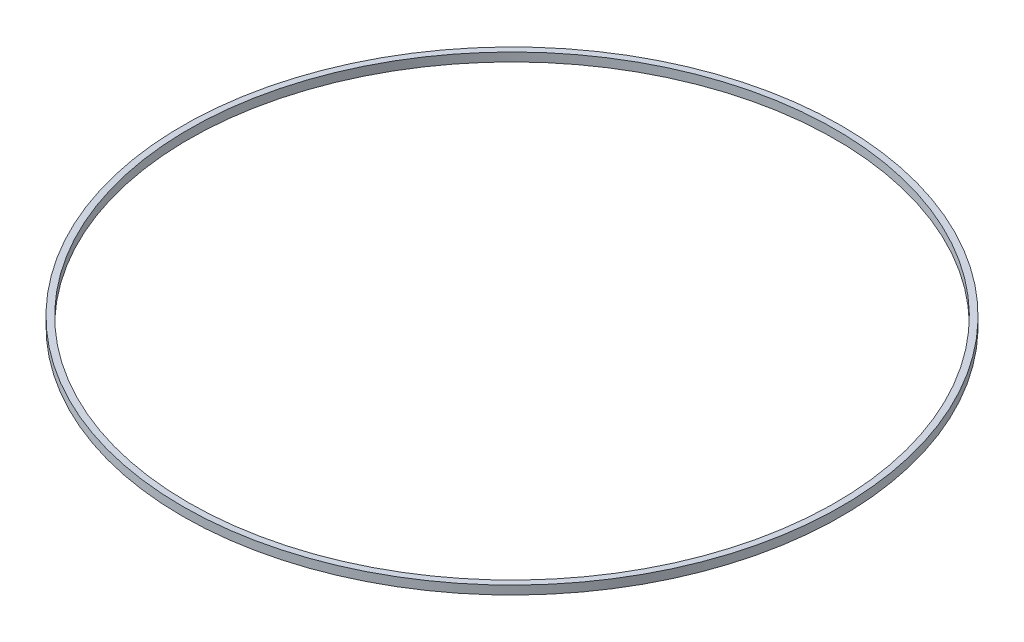
ISO-10303-21;
HEADER;
FILE_DESCRIPTION(('STEP AP214'),'2;1');
FILE_NAME('part.step','',(''),(''),'','','');
FILE_SCHEMA(('AUTOMOTIVE_DESIGN { 1 0 10303 214 1 1 1 1 }'));
ENDSEC;
DATA;
#1=APPLICATION_CONTEXT('core data for automotive mechanical design processes');
#2=APPLICATION_PROTOCOL_DEFINITION('international standard','automotive_design',2000,#1);
#3=PRODUCT_CONTEXT('',#1,'mechanical');
#4=PRODUCT('Part','Part','',(#3));
#5=PRODUCT_RELATED_PRODUCT_CATEGORY('part','',(#4));
#6=PRODUCT_DEFINITION_FORMATION('','',#4);
#7=PRODUCT_DEFINITION_CONTEXT('part definition',#1,'design');
#8=PRODUCT_DEFINITION('design','',#6,#7);
#9=PRODUCT_DEFINITION_SHAPE('','',#8);
#10=(LENGTH_UNIT() NAMED_UNIT(*) SI_UNIT(.MILLI.,.METRE.));
#11=(NAMED_UNIT(*) PLANE_ANGLE_UNIT() SI_UNIT($,.RADIAN.));
#12=(NAMED_UNIT(*) SI_UNIT($,.STERADIAN.) SOLID_ANGLE_UNIT());
#13=UNCERTAINTY_MEASURE_WITH_UNIT(LENGTH_MEASURE(1.E-05),#10,'distance_accuracy_value','');
#14=(GEOMETRIC_REPRESENTATION_CONTEXT(3) GLOBAL_UNCERTAINTY_ASSIGNED_CONTEXT((#13)) GLOBAL_UNIT_ASSIGNED_CONTEXT((#10,
#11,#12)) REPRESENTATION_CONTEXT('',''));
#15=CARTESIAN_POINT('',(0.,0.,0.));
#16=DIRECTION('',(0.,0.,1.));
#17=DIRECTION('',(1.,0.,0.));
#18=AXIS2_PLACEMENT_3D('',#15,#16,#17);
#19=CARTESIAN_POINT('',(0.,1.4,0.));
#20=DIRECTION('',(0.,1.,0.));
#21=DIRECTION('',(0.,0.,1.));
#22=AXIS2_PLACEMENT_3D('',#19,#20,#21);
#23=PLANE('',#22);
#24=CARTESIAN_POINT('',(0.,1.4,0.));
#25=DIRECTION('',(0.,1.,0.));
#26=DIRECTION('',(0.,0.,1.));
#27=AXIS2_PLACEMENT_3D('',#24,#25,#26);
#28=CIRCLE('',#27,53.52);
#29=CARTESIAN_POINT('',(0.,1.4,53.52));
#30=VERTEX_POINT('',#29);
#31=EDGE_CURVE('E10',#30,#30,#28,.T.);
#32=ORIENTED_EDGE('',*,*,#31,.T.);
#33=EDGE_LOOP('',(#32));
#34=FACE_BOUND('',#33,.T.);
#35=CARTESIAN_POINT('',(0.,1.4,0.));
#36=DIRECTION('',(0.,1.,0.));
#37=DIRECTION('',(0.,0.,1.));
#38=AXIS2_PLACEMENT_3D('',#35,#36,#37);
#39=CIRCLE('',#38,52.52);
#40=CARTESIAN_POINT('',(0.,1.4,52.52));
#41=VERTEX_POINT('',#40);
#42=EDGE_CURVE('E42',#41,#41,#39,.T.);
#43=ORIENTED_EDGE('',*,*,#42,.F.);
#44=EDGE_LOOP('',(#43));
#45=FACE_BOUND('',#44,.T.);
#46=ADVANCED_FACE('F31',(#34,#45),#23,.T.);
#47=CARTESIAN_POINT('',(0.,0.,0.));
#48=DIRECTION('',(0.,1.,0.));
#49=DIRECTION('',(0.,0.,1.));
#50=AXIS2_PLACEMENT_3D('',#47,#48,#49);
#51=PLANE('',#50);
#52=CARTESIAN_POINT('',(0.,0.,0.));
#53=DIRECTION('',(0.,1.,0.));
#54=DIRECTION('',(0.,0.,1.));
#55=AXIS2_PLACEMENT_3D('',#52,#53,#54);
#56=CIRCLE('',#55,53.52);
#57=CARTESIAN_POINT('',(0.,0.,53.52));
#58=VERTEX_POINT('',#57);
#59=EDGE_CURVE('E35',#58,#58,#56,.T.);
#60=ORIENTED_EDGE('',*,*,#59,.F.);
#61=EDGE_LOOP('',(#60));
#62=FACE_BOUND('',#61,.T.);
#63=CARTESIAN_POINT('',(0.,0.,0.));
#64=DIRECTION('',(0.,1.,0.));
#65=DIRECTION('',(0.,0.,1.));
#66=AXIS2_PLACEMENT_3D('',#63,#64,#65);
#67=CIRCLE('',#66,52.52);
#68=CARTESIAN_POINT('',(0.,0.,52.52));
#69=VERTEX_POINT('',#68);
#70=EDGE_CURVE('E44',#69,#69,#67,.T.);
#71=ORIENTED_EDGE('',*,*,#70,.T.);
#72=EDGE_LOOP('',(#71));
#73=FACE_BOUND('',#72,.T.);
#74=ADVANCED_FACE('F54',(#62,#73),#51,.F.);
#75=CARTESIAN_POINT('',(0.,1.4,0.));
#76=DIRECTION('',(0.,-1.,0.));
#77=DIRECTION('',(0.,0.,-1.));
#78=AXIS2_PLACEMENT_3D('',#75,#76,#77);
#79=CYLINDRICAL_SURFACE('',#78,53.52);
#80=ORIENTED_EDGE('',*,*,#31,.F.);
#81=EDGE_LOOP('',(#80));
#82=FACE_BOUND('',#81,.T.);
#83=ORIENTED_EDGE('',*,*,#59,.T.);
#84=EDGE_LOOP('',(#83));
#85=FACE_BOUND('',#84,.T.);
#86=ADVANCED_FACE('F33',(#82,#85),#79,.T.);
#87=CARTESIAN_POINT('',(0.,1.4,0.));
#88=DIRECTION('',(0.,-1.,0.));
#89=DIRECTION('',(0.,0.,-1.));
#90=AXIS2_PLACEMENT_3D('',#87,#88,#89);
#91=CYLINDRICAL_SURFACE('',#90,52.52);
#92=ORIENTED_EDGE('',*,*,#42,.T.);
#93=EDGE_LOOP('',(#92));
#94=FACE_BOUND('',#93,.T.);
#95=ORIENTED_EDGE('',*,*,#70,.F.);
#96=EDGE_LOOP('',(#95));
#97=FACE_BOUND('',#96,.T.);
#98=ADVANCED_FACE('F50',(#94,#97),#91,.F.);
#99=CLOSED_SHELL('',(#46,#74,#86,#98));
#100=MANIFOLD_SOLID_BREP('B2',#99);
#101=ADVANCED_BREP_SHAPE_REPRESENTATION('',(#18,#100),#14);
#102=SHAPE_DEFINITION_REPRESENTATION(#9,#101);
ENDSEC;
END-ISO-10303-21;
